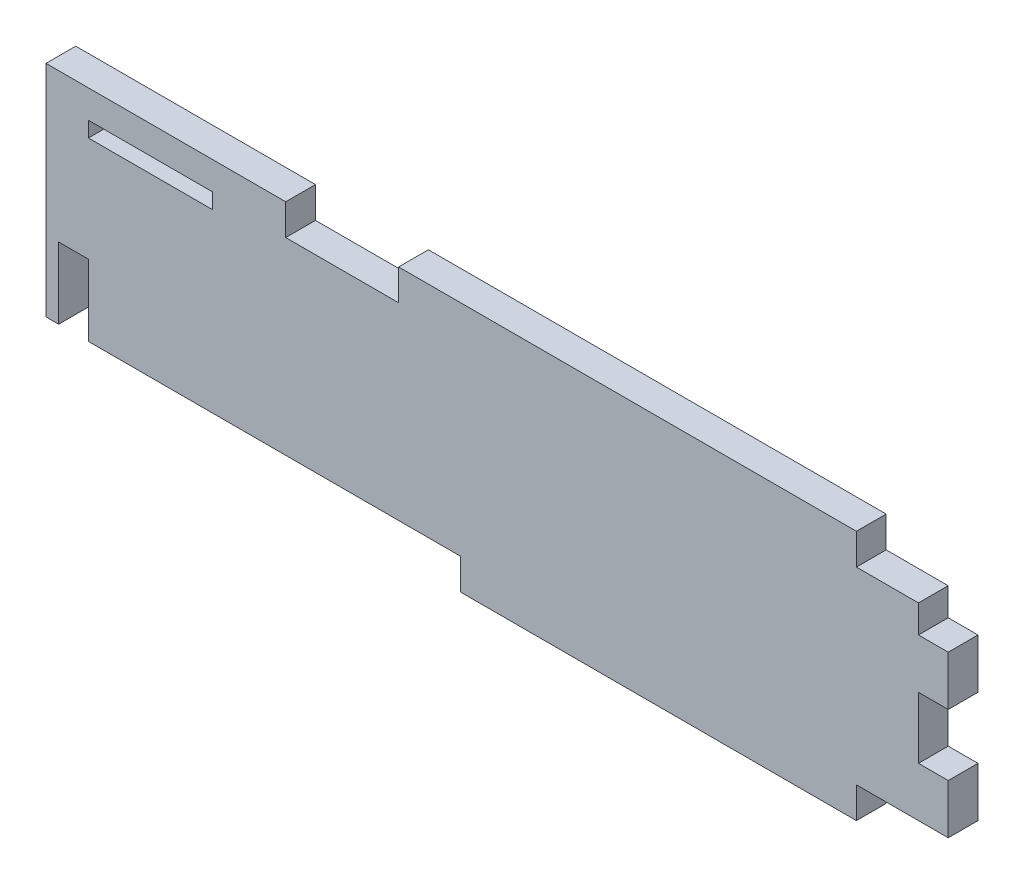
ISO-10303-21;
HEADER;
FILE_DESCRIPTION(('STEP AP214'),'2;1');
FILE_NAME('part.step','',(''),(''),'','','');
FILE_SCHEMA(('AUTOMOTIVE_DESIGN { 1 0 10303 214 1 1 1 1 }'));
ENDSEC;
DATA;
#1=APPLICATION_CONTEXT('core data for automotive mechanical design processes');
#2=APPLICATION_PROTOCOL_DEFINITION('international standard','automotive_design',2000,#1);
#3=PRODUCT_CONTEXT('',#1,'mechanical');
#4=PRODUCT('Part','Part','',(#3));
#5=PRODUCT_RELATED_PRODUCT_CATEGORY('part','',(#4));
#6=PRODUCT_DEFINITION_FORMATION('','',#4);
#7=PRODUCT_DEFINITION_CONTEXT('part definition',#1,'design');
#8=PRODUCT_DEFINITION('design','',#6,#7);
#9=PRODUCT_DEFINITION_SHAPE('','',#8);
#10=(LENGTH_UNIT() NAMED_UNIT(*) SI_UNIT(.MILLI.,.METRE.));
#11=(NAMED_UNIT(*) PLANE_ANGLE_UNIT() SI_UNIT($,.RADIAN.));
#12=(NAMED_UNIT(*) SI_UNIT($,.STERADIAN.) SOLID_ANGLE_UNIT());
#13=UNCERTAINTY_MEASURE_WITH_UNIT(LENGTH_MEASURE(1.E-05),#10,'distance_accuracy_value','');
#14=(GEOMETRIC_REPRESENTATION_CONTEXT(3) GLOBAL_UNCERTAINTY_ASSIGNED_CONTEXT((#13)) GLOBAL_UNIT_ASSIGNED_CONTEXT((#10,
#11,#12)) REPRESENTATION_CONTEXT('',''));
#15=CARTESIAN_POINT('',(0.,0.,0.));
#16=DIRECTION('',(0.,0.,1.));
#17=DIRECTION('',(1.,0.,0.));
#18=AXIS2_PLACEMENT_3D('',#15,#16,#17);
#19=CARTESIAN_POINT('',(0.,24.3332,3.048));
#20=DIRECTION('',(0.,-1.,0.));
#21=DIRECTION('',(0.,0.,-1.));
#22=AXIS2_PLACEMENT_3D('',#19,#20,#21);
#23=PLANE('',#22);
#24=DIRECTION('',(-1.,0.,0.));
#25=VECTOR('',#24,1.);
#26=CARTESIAN_POINT('',(0.,24.3332,0.));
#27=LINE('',#26,#25);
#28=CARTESIAN_POINT('',(-72.263,24.3332,0.));
#29=VERTEX_POINT('',#28);
#30=CARTESIAN_POINT('',(-84.963,24.3332,0.));
#31=VERTEX_POINT('',#30);
#32=EDGE_CURVE('E315',#29,#31,#27,.T.);
#33=ORIENTED_EDGE('',*,*,#32,.F.);
#34=DIRECTION('',(0.,0.,-1.));
#35=VECTOR('',#34,1.);
#36=CARTESIAN_POINT('',(-72.263,24.3332,3.048));
#37=LINE('',#36,#35);
#38=CARTESIAN_POINT('',(-72.263,24.3332,3.048));
#39=VERTEX_POINT('',#38);
#40=EDGE_CURVE('E11',#39,#29,#37,.T.);
#41=ORIENTED_EDGE('',*,*,#40,.F.);
#42=DIRECTION('',(-1.,0.,0.));
#43=VECTOR('',#42,1.);
#44=CARTESIAN_POINT('',(0.,24.3332,3.048));
#45=LINE('',#44,#43);
#46=CARTESIAN_POINT('',(-84.963,24.3332,3.048));
#47=VERTEX_POINT('',#46);
#48=EDGE_CURVE('E242',#39,#47,#45,.T.);
#49=ORIENTED_EDGE('',*,*,#48,.T.);
#50=DIRECTION('',(0.,0.,-1.));
#51=VECTOR('',#50,1.);
#52=CARTESIAN_POINT('',(-84.963,24.3332,3.048));
#53=LINE('',#52,#51);
#54=EDGE_CURVE('E61',#47,#31,#53,.T.);
#55=ORIENTED_EDGE('',*,*,#54,.T.);
#56=EDGE_LOOP('',(#33,#41,#49,#55));
#57=FACE_BOUND('',#56,.T.);
#58=ADVANCED_FACE('F35',(#57),#23,.T.);
#59=CARTESIAN_POINT('',(-72.263,0.,3.048));
#60=DIRECTION('',(-1.,0.,0.));
#61=DIRECTION('',(0.,0.,1.));
#62=AXIS2_PLACEMENT_3D('',#59,#60,#61);
#63=PLANE('',#62);
#64=DIRECTION('',(0.,1.,0.));
#65=VECTOR('',#64,1.);
#66=CARTESIAN_POINT('',(-72.263,0.,0.));
#67=LINE('',#66,#65);
#68=CARTESIAN_POINT('',(-72.263,22.7584,0.));
#69=VERTEX_POINT('',#68);
#70=EDGE_CURVE('E229',#69,#29,#67,.T.);
#71=ORIENTED_EDGE('',*,*,#70,.F.);
#72=DIRECTION('',(0.,0.,-1.));
#73=VECTOR('',#72,1.);
#74=CARTESIAN_POINT('',(-72.263,22.7584,3.048));
#75=LINE('',#74,#73);
#76=CARTESIAN_POINT('',(-72.263,22.7584,3.048));
#77=VERTEX_POINT('',#76);
#78=EDGE_CURVE('E44',#77,#69,#75,.T.);
#79=ORIENTED_EDGE('',*,*,#78,.F.);
#80=DIRECTION('',(0.,1.,0.));
#81=VECTOR('',#80,1.);
#82=CARTESIAN_POINT('',(-72.263,0.,3.048));
#83=LINE('',#82,#81);
#84=EDGE_CURVE('E227',#77,#39,#83,.T.);
#85=ORIENTED_EDGE('',*,*,#84,.T.);
#86=ORIENTED_EDGE('',*,*,#40,.T.);
#87=EDGE_LOOP('',(#71,#79,#85,#86));
#88=FACE_BOUND('',#87,.T.);
#89=ADVANCED_FACE('F226',(#88),#63,.T.);
#90=CARTESIAN_POINT('',(0.,22.7584,3.048));
#91=DIRECTION('',(0.,1.,0.));
#92=DIRECTION('',(0.,0.,1.));
#93=AXIS2_PLACEMENT_3D('',#90,#91,#92);
#94=PLANE('',#93);
#95=DIRECTION('',(1.,0.,0.));
#96=VECTOR('',#95,1.);
#97=CARTESIAN_POINT('',(0.,22.7584,0.));
#98=LINE('',#97,#96);
#99=CARTESIAN_POINT('',(-84.963,22.7584,0.));
#100=VERTEX_POINT('',#99);
#101=EDGE_CURVE('E318',#100,#69,#98,.T.);
#102=ORIENTED_EDGE('',*,*,#101,.F.);
#103=DIRECTION('',(0.,0.,-1.));
#104=VECTOR('',#103,1.);
#105=CARTESIAN_POINT('',(-84.963,22.7584,3.048));
#106=LINE('',#105,#104);
#107=CARTESIAN_POINT('',(-84.963,22.7584,3.048));
#108=VERTEX_POINT('',#107);
#109=EDGE_CURVE('E234',#108,#100,#106,.T.);
#110=ORIENTED_EDGE('',*,*,#109,.F.);
#111=DIRECTION('',(1.,0.,0.));
#112=VECTOR('',#111,1.);
#113=CARTESIAN_POINT('',(0.,22.7584,3.048));
#114=LINE('',#113,#112);
#115=EDGE_CURVE('E241',#108,#77,#114,.T.);
#116=ORIENTED_EDGE('',*,*,#115,.T.);
#117=ORIENTED_EDGE('',*,*,#78,.T.);
#118=EDGE_LOOP('',(#102,#110,#116,#117));
#119=FACE_BOUND('',#118,.T.);
#120=ADVANCED_FACE('F244',(#119),#94,.T.);
#121=CARTESIAN_POINT('',(-64.77,0.,3.048));
#122=DIRECTION('',(1.,0.,0.));
#123=DIRECTION('',(0.,0.,-1.));
#124=AXIS2_PLACEMENT_3D('',#121,#122,#123);
#125=PLANE('',#124);
#126=DIRECTION('',(0.,-1.,0.));
#127=VECTOR('',#126,1.);
#128=CARTESIAN_POINT('',(-64.77,0.,0.));
#129=LINE('',#128,#127);
#130=CARTESIAN_POINT('',(-64.77,27.2034,0.));
#131=VERTEX_POINT('',#130);
#132=CARTESIAN_POINT('',(-64.77,24.0284,0.));
#133=VERTEX_POINT('',#132);
#134=EDGE_CURVE('E251',#131,#133,#129,.T.);
#135=ORIENTED_EDGE('',*,*,#134,.F.);
#136=DIRECTION('',(0.,0.,-1.));
#137=VECTOR('',#136,1.);
#138=CARTESIAN_POINT('',(-64.77,27.2034,3.048));
#139=LINE('',#138,#137);
#140=CARTESIAN_POINT('',(-64.77,27.2034,3.048));
#141=VERTEX_POINT('',#140);
#142=EDGE_CURVE('E39',#141,#131,#139,.T.);
#143=ORIENTED_EDGE('',*,*,#142,.F.);
#144=DIRECTION('',(0.,-1.,0.));
#145=VECTOR('',#144,1.);
#146=CARTESIAN_POINT('',(-64.77,0.,3.048));
#147=LINE('',#146,#145);
#148=CARTESIAN_POINT('',(-64.77,24.0284,3.048));
#149=VERTEX_POINT('',#148);
#150=EDGE_CURVE('E323',#141,#149,#147,.T.);
#151=ORIENTED_EDGE('',*,*,#150,.T.);
#152=DIRECTION('',(0.,0.,-1.));
#153=VECTOR('',#152,1.);
#154=CARTESIAN_POINT('',(-64.77,24.0284,3.048));
#155=LINE('',#154,#153);
#156=EDGE_CURVE('E247',#149,#133,#155,.T.);
#157=ORIENTED_EDGE('',*,*,#156,.T.);
#158=EDGE_LOOP('',(#135,#143,#151,#157));
#159=FACE_BOUND('',#158,.T.);
#160=ADVANCED_FACE('F37',(#159),#125,.T.);
#161=CARTESIAN_POINT('',(0.,27.2034,3.048));
#162=DIRECTION('',(0.,1.,0.));
#163=DIRECTION('',(0.,0.,1.));
#164=AXIS2_PLACEMENT_3D('',#161,#162,#163);
#165=PLANE('',#164);
#166=DIRECTION('',(1.,0.,0.));
#167=VECTOR('',#166,1.);
#168=CARTESIAN_POINT('',(0.,27.2034,0.));
#169=LINE('',#168,#167);
#170=CARTESIAN_POINT('',(-89.3064,27.2034,0.));
#171=VERTEX_POINT('',#170);
#172=EDGE_CURVE('E254',#171,#131,#169,.T.);
#173=ORIENTED_EDGE('',*,*,#172,.F.);
#174=DIRECTION('',(0.,0.,-1.));
#175=VECTOR('',#174,1.);
#176=CARTESIAN_POINT('',(-89.3064,27.2034,3.048));
#177=LINE('',#176,#175);
#178=CARTESIAN_POINT('',(-89.3064,27.2034,3.048));
#179=VERTEX_POINT('',#178);
#180=EDGE_CURVE('E369',#179,#171,#177,.T.);
#181=ORIENTED_EDGE('',*,*,#180,.F.);
#182=DIRECTION('',(1.,0.,0.));
#183=VECTOR('',#182,1.);
#184=CARTESIAN_POINT('',(0.,27.2034,3.048));
#185=LINE('',#184,#183);
#186=EDGE_CURVE('E378',#179,#141,#185,.T.);
#187=ORIENTED_EDGE('',*,*,#186,.T.);
#188=ORIENTED_EDGE('',*,*,#142,.T.);
#189=EDGE_LOOP('',(#173,#181,#187,#188));
#190=FACE_BOUND('',#189,.T.);
#191=ADVANCED_FACE('F376',(#190),#165,.T.);
#192=CARTESIAN_POINT('',(-89.3064,0.,3.048));
#193=DIRECTION('',(-1.,0.,0.));
#194=DIRECTION('',(0.,0.,1.));
#195=AXIS2_PLACEMENT_3D('',#192,#193,#194);
#196=PLANE('',#195);
#197=DIRECTION('',(0.,1.,0.));
#198=VECTOR('',#197,1.);
#199=CARTESIAN_POINT('',(-89.3064,0.,0.));
#200=LINE('',#199,#198);
#201=CARTESIAN_POINT('',(-89.3064,4.72440000000001,0.));
#202=VERTEX_POINT('',#201);
#203=EDGE_CURVE('E258',#202,#171,#200,.T.);
#204=ORIENTED_EDGE('',*,*,#203,.F.);
#205=DIRECTION('',(0.,0.,-1.));
#206=VECTOR('',#205,1.);
#207=CARTESIAN_POINT('',(-89.3064,4.72440000000001,3.048));
#208=LINE('',#207,#206);
#209=CARTESIAN_POINT('',(-89.3064,4.72440000000001,3.048));
#210=VERTEX_POINT('',#209);
#211=EDGE_CURVE('E368',#210,#202,#208,.T.);
#212=ORIENTED_EDGE('',*,*,#211,.F.);
#213=DIRECTION('',(0.,1.,0.));
#214=VECTOR('',#213,1.);
#215=CARTESIAN_POINT('',(-89.3064,0.,3.048));
#216=LINE('',#215,#214);
#217=EDGE_CURVE('E385',#210,#179,#216,.T.);
#218=ORIENTED_EDGE('',*,*,#217,.T.);
#219=ORIENTED_EDGE('',*,*,#180,.T.);
#220=EDGE_LOOP('',(#204,#212,#218,#219));
#221=FACE_BOUND('',#220,.T.);
#222=ADVANCED_FACE('F382',(#221),#196,.T.);
#223=CARTESIAN_POINT('',(0.,4.72440000000001,3.048));
#224=DIRECTION('',(0.,1.,0.));
#225=DIRECTION('',(0.,0.,1.));
#226=AXIS2_PLACEMENT_3D('',#223,#224,#225);
#227=PLANE('',#226);
#228=DIRECTION('',(1.,0.,0.));
#229=VECTOR('',#228,1.);
#230=CARTESIAN_POINT('',(0.,4.72440000000001,0.));
#231=LINE('',#230,#229);
#232=CARTESIAN_POINT('',(-88.011,4.7244,0.));
#233=VERTEX_POINT('',#232);
#234=EDGE_CURVE('E261',#202,#233,#231,.T.);
#235=ORIENTED_EDGE('',*,*,#234,.T.);
#236=DIRECTION('',(0.,0.,1.));
#237=VECTOR('',#236,1.);
#238=CARTESIAN_POINT('',(-88.011,4.7244,0.));
#239=LINE('',#238,#237);
#240=CARTESIAN_POINT('',(-88.011,4.7244,3.048));
#241=VERTEX_POINT('',#240);
#242=EDGE_CURVE('E393',#233,#241,#239,.T.);
#243=ORIENTED_EDGE('',*,*,#242,.T.);
#244=DIRECTION('',(1.,0.,0.));
#245=VECTOR('',#244,1.);
#246=CARTESIAN_POINT('',(0.,4.72440000000001,3.048));
#247=LINE('',#246,#245);
#248=EDGE_CURVE('E389',#210,#241,#247,.T.);
#249=ORIENTED_EDGE('',*,*,#248,.F.);
#250=ORIENTED_EDGE('',*,*,#211,.T.);
#251=EDGE_LOOP('',(#235,#243,#249,#250));
#252=FACE_BOUND('',#251,.T.);
#253=ADVANCED_FACE('F390',(#252),#227,.F.);
#254=CARTESIAN_POINT('',(0.,12.0142,3.048));
#255=DIRECTION('',(0.,1.,0.));
#256=DIRECTION('',(0.,0.,1.));
#257=AXIS2_PLACEMENT_3D('',#254,#255,#256);
#258=PLANE('',#257);
#259=DIRECTION('',(1.,0.,0.));
#260=VECTOR('',#259,1.);
#261=CARTESIAN_POINT('',(0.,12.0142,0.));
#262=LINE('',#261,#260);
#263=CARTESIAN_POINT('',(-88.011,12.0142,0.));
#264=VERTEX_POINT('',#263);
#265=CARTESIAN_POINT('',(-84.963,12.0142,0.));
#266=VERTEX_POINT('',#265);
#267=EDGE_CURVE('E52',#264,#266,#262,.T.);
#268=ORIENTED_EDGE('',*,*,#267,.T.);
#269=DIRECTION('',(0.,0.,-1.));
#270=VECTOR('',#269,1.);
#271=CARTESIAN_POINT('',(-84.963,12.0142,3.048));
#272=LINE('',#271,#270);
#273=CARTESIAN_POINT('',(-84.963,12.0142,3.048));
#274=VERTEX_POINT('',#273);
#275=EDGE_CURVE('E365',#274,#266,#272,.T.);
#276=ORIENTED_EDGE('',*,*,#275,.F.);
#277=DIRECTION('',(1.,0.,0.));
#278=VECTOR('',#277,1.);
#279=CARTESIAN_POINT('',(0.,12.0142,3.048));
#280=LINE('',#279,#278);
#281=CARTESIAN_POINT('',(-88.011,12.0142,3.048));
#282=VERTEX_POINT('',#281);
#283=EDGE_CURVE('E396',#282,#274,#280,.T.);
#284=ORIENTED_EDGE('',*,*,#283,.F.);
#285=DIRECTION('',(0.,0.,1.));
#286=VECTOR('',#285,1.);
#287=CARTESIAN_POINT('',(-88.011,12.0142,0.));
#288=LINE('',#287,#286);
#289=EDGE_CURVE('E255',#264,#282,#288,.T.);
#290=ORIENTED_EDGE('',*,*,#289,.F.);
#291=EDGE_LOOP('',(#268,#276,#284,#290));
#292=FACE_BOUND('',#291,.T.);
#293=ADVANCED_FACE('F539',(#292),#258,.F.);
#294=CARTESIAN_POINT('',(-84.963,0.,3.048));
#295=DIRECTION('',(1.,0.,0.));
#296=DIRECTION('',(0.,0.,-1.));
#297=AXIS2_PLACEMENT_3D('',#294,#295,#296);
#298=PLANE('',#297);
#299=DIRECTION('',(0.,-1.,0.));
#300=VECTOR('',#299,1.);
#301=CARTESIAN_POINT('',(-84.963,0.,0.));
#302=LINE('',#301,#300);
#303=CARTESIAN_POINT('',(-84.963,4.7244,0.));
#304=VERTEX_POINT('',#303);
#305=EDGE_CURVE('E265',#266,#304,#302,.T.);
#306=ORIENTED_EDGE('',*,*,#305,.T.);
#307=DIRECTION('',(0.,0.,-1.));
#308=VECTOR('',#307,1.);
#309=CARTESIAN_POINT('',(-84.963,4.7244,3.048));
#310=LINE('',#309,#308);
#311=CARTESIAN_POINT('',(-84.963,4.7244,3.048));
#312=VERTEX_POINT('',#311);
#313=EDGE_CURVE('E362',#312,#304,#310,.T.);
#314=ORIENTED_EDGE('',*,*,#313,.F.);
#315=DIRECTION('',(0.,-1.,0.));
#316=VECTOR('',#315,1.);
#317=CARTESIAN_POINT('',(-84.963,0.,3.048));
#318=LINE('',#317,#316);
#319=EDGE_CURVE('E403',#274,#312,#318,.T.);
#320=ORIENTED_EDGE('',*,*,#319,.F.);
#321=ORIENTED_EDGE('',*,*,#275,.T.);
#322=EDGE_LOOP('',(#306,#314,#320,#321));
#323=FACE_BOUND('',#322,.T.);
#324=ADVANCED_FACE('F535',(#323),#298,.F.);
#325=CARTESIAN_POINT('',(0.,4.7244,3.048));
#326=DIRECTION('',(0.,1.,0.));
#327=DIRECTION('',(0.,0.,1.));
#328=AXIS2_PLACEMENT_3D('',#325,#326,#327);
#329=PLANE('',#328);
#330=DIRECTION('',(1.,0.,0.));
#331=VECTOR('',#330,1.);
#332=CARTESIAN_POINT('',(0.,4.7244,0.));
#333=LINE('',#332,#331);
#334=CARTESIAN_POINT('',(-46.863,4.7244,0.));
#335=VERTEX_POINT('',#334);
#336=EDGE_CURVE('E267',#304,#335,#333,.T.);
#337=ORIENTED_EDGE('',*,*,#336,.T.);
#338=DIRECTION('',(0.,0.,-1.));
#339=VECTOR('',#338,1.);
#340=CARTESIAN_POINT('',(-46.863,4.7244,3.048));
#341=LINE('',#340,#339);
#342=CARTESIAN_POINT('',(-46.863,4.7244,3.048));
#343=VERTEX_POINT('',#342);
#344=EDGE_CURVE('E360',#343,#335,#341,.T.);
#345=ORIENTED_EDGE('',*,*,#344,.F.);
#346=DIRECTION('',(1.,0.,0.));
#347=VECTOR('',#346,1.);
#348=CARTESIAN_POINT('',(0.,4.7244,3.048));
#349=LINE('',#348,#347);
#350=EDGE_CURVE('E405',#312,#343,#349,.T.);
#351=ORIENTED_EDGE('',*,*,#350,.F.);
#352=ORIENTED_EDGE('',*,*,#313,.T.);
#353=EDGE_LOOP('',(#337,#345,#351,#352));
#354=FACE_BOUND('',#353,.T.);
#355=ADVANCED_FACE('F531',(#354),#329,.F.);
#356=CARTESIAN_POINT('',(-46.863,0.,3.048));
#357=DIRECTION('',(-1.,0.,0.));
#358=DIRECTION('',(0.,0.,1.));
#359=AXIS2_PLACEMENT_3D('',#356,#357,#358);
#360=PLANE('',#359);
#361=DIRECTION('',(0.,1.,0.));
#362=VECTOR('',#361,1.);
#363=CARTESIAN_POINT('',(-46.863,0.,0.));
#364=LINE('',#363,#362);
#365=CARTESIAN_POINT('',(-46.863,1.5494,0.));
#366=VERTEX_POINT('',#365);
#367=EDGE_CURVE('E270',#366,#335,#364,.T.);
#368=ORIENTED_EDGE('',*,*,#367,.F.);
#369=DIRECTION('',(0.,0.,-1.));
#370=VECTOR('',#369,1.);
#371=CARTESIAN_POINT('',(-46.863,1.5494,3.048));
#372=LINE('',#371,#370);
#373=CARTESIAN_POINT('',(-46.863,1.5494,3.048));
#374=VERTEX_POINT('',#373);
#375=EDGE_CURVE('E358',#374,#366,#372,.T.);
#376=ORIENTED_EDGE('',*,*,#375,.F.);
#377=DIRECTION('',(0.,1.,0.));
#378=VECTOR('',#377,1.);
#379=CARTESIAN_POINT('',(-46.863,0.,3.048));
#380=LINE('',#379,#378);
#381=EDGE_CURVE('E407',#374,#343,#380,.T.);
#382=ORIENTED_EDGE('',*,*,#381,.T.);
#383=ORIENTED_EDGE('',*,*,#344,.T.);
#384=EDGE_LOOP('',(#368,#376,#382,#383));
#385=FACE_BOUND('',#384,.T.);
#386=ADVANCED_FACE('F527',(#385),#360,.T.);
#387=CARTESIAN_POINT('',(0.,1.5494,3.048));
#388=DIRECTION('',(0.,-1.,0.));
#389=DIRECTION('',(1.,0.,0.));
#390=AXIS2_PLACEMENT_3D('',#387,#388,#389);
#391=PLANE('',#390);
#392=DIRECTION('',(-1.,0.,0.));
#393=VECTOR('',#392,1.);
#394=CARTESIAN_POINT('',(0.,1.5494,0.));
#395=LINE('',#394,#393);
#396=CARTESIAN_POINT('',(-6.35,1.5494,0.));
#397=VERTEX_POINT('',#396);
#398=EDGE_CURVE('E273',#397,#366,#395,.T.);
#399=ORIENTED_EDGE('',*,*,#398,.F.);
#400=DIRECTION('',(0.,0.,-1.));
#401=VECTOR('',#400,1.);
#402=CARTESIAN_POINT('',(-6.35,1.5494,3.048));
#403=LINE('',#402,#401);
#404=CARTESIAN_POINT('',(-6.35,1.5494,3.048));
#405=VERTEX_POINT('',#404);
#406=EDGE_CURVE('E356',#405,#397,#403,.T.);
#407=ORIENTED_EDGE('',*,*,#406,.F.);
#408=DIRECTION('',(-1.,0.,0.));
#409=VECTOR('',#408,1.);
#410=CARTESIAN_POINT('',(0.,1.5494,3.048));
#411=LINE('',#410,#409);
#412=EDGE_CURVE('E410',#405,#374,#411,.T.);
#413=ORIENTED_EDGE('',*,*,#412,.T.);
#414=ORIENTED_EDGE('',*,*,#375,.T.);
#415=EDGE_LOOP('',(#399,#407,#413,#414));
#416=FACE_BOUND('',#415,.T.);
#417=ADVANCED_FACE('F523',(#416),#391,.T.);
#418=CARTESIAN_POINT('',(-6.35,0.,3.048));
#419=DIRECTION('',(1.,0.,0.));
#420=DIRECTION('',(0.,0.,-1.));
#421=AXIS2_PLACEMENT_3D('',#418,#419,#420);
#422=PLANE('',#421);
#423=DIRECTION('',(0.,-1.,0.));
#424=VECTOR('',#423,1.);
#425=CARTESIAN_POINT('',(-6.35,0.,0.));
#426=LINE('',#425,#424);
#427=CARTESIAN_POINT('',(-6.35,4.7244,0.));
#428=VERTEX_POINT('',#427);
#429=EDGE_CURVE('E276',#428,#397,#426,.T.);
#430=ORIENTED_EDGE('',*,*,#429,.F.);
#431=DIRECTION('',(0.,0.,-1.));
#432=VECTOR('',#431,1.);
#433=CARTESIAN_POINT('',(-6.35,4.7244,3.048));
#434=LINE('',#433,#432);
#435=CARTESIAN_POINT('',(-6.35,4.7244,3.048));
#436=VERTEX_POINT('',#435);
#437=EDGE_CURVE('E354',#436,#428,#434,.T.);
#438=ORIENTED_EDGE('',*,*,#437,.F.);
#439=DIRECTION('',(0.,-1.,0.));
#440=VECTOR('',#439,1.);
#441=CARTESIAN_POINT('',(-6.35,0.,3.048));
#442=LINE('',#441,#440);
#443=EDGE_CURVE('E413',#436,#405,#442,.T.);
#444=ORIENTED_EDGE('',*,*,#443,.T.);
#445=ORIENTED_EDGE('',*,*,#406,.T.);
#446=EDGE_LOOP('',(#430,#438,#444,#445));
#447=FACE_BOUND('',#446,.T.);
#448=ADVANCED_FACE('F519',(#447),#422,.T.);
#449=CARTESIAN_POINT('',(0.,4.72439999999999,3.048));
#450=DIRECTION('',(0.,1.,0.));
#451=DIRECTION('',(-1.,0.,0.));
#452=AXIS2_PLACEMENT_3D('',#449,#450,#451);
#453=PLANE('',#452);
#454=DIRECTION('',(1.,0.,0.));
#455=VECTOR('',#454,1.);
#456=CARTESIAN_POINT('',(0.,4.72439999999999,0.));
#457=LINE('',#456,#455);
#458=CARTESIAN_POINT('',(3.048,4.72439999999999,0.));
#459=VERTEX_POINT('',#458);
#460=EDGE_CURVE('E279',#428,#459,#457,.T.);
#461=ORIENTED_EDGE('',*,*,#460,.T.);
#462=DIRECTION('',(0.,0.,-1.));
#463=VECTOR('',#462,1.);
#464=CARTESIAN_POINT('',(3.048,4.72439999999999,3.048));
#465=LINE('',#464,#463);
#466=CARTESIAN_POINT('',(3.048,4.72439999999999,3.048));
#467=VERTEX_POINT('',#466);
#468=EDGE_CURVE('E352',#467,#459,#465,.T.);
#469=ORIENTED_EDGE('',*,*,#468,.F.);
#470=DIRECTION('',(1.,0.,0.));
#471=VECTOR('',#470,1.);
#472=CARTESIAN_POINT('',(0.,4.72439999999999,3.048));
#473=LINE('',#472,#471);
#474=EDGE_CURVE('E416',#436,#467,#473,.T.);
#475=ORIENTED_EDGE('',*,*,#474,.F.);
#476=ORIENTED_EDGE('',*,*,#437,.T.);
#477=EDGE_LOOP('',(#461,#469,#475,#476));
#478=FACE_BOUND('',#477,.T.);
#479=ADVANCED_FACE('F515',(#478),#453,.F.);
#480=CARTESIAN_POINT('',(3.048,0.,3.048));
#481=DIRECTION('',(1.,0.,0.));
#482=DIRECTION('',(0.,0.,-1.));
#483=AXIS2_PLACEMENT_3D('',#480,#481,#482);
#484=PLANE('',#483);
#485=DIRECTION('',(0.,-1.,0.));
#486=VECTOR('',#485,1.);
#487=CARTESIAN_POINT('',(3.048,0.,0.));
#488=LINE('',#487,#486);
#489=CARTESIAN_POINT('',(3.048,9.80439999999999,0.));
#490=VERTEX_POINT('',#489);
#491=EDGE_CURVE('E282',#490,#459,#488,.T.);
#492=ORIENTED_EDGE('',*,*,#491,.F.);
#493=DIRECTION('',(0.,0.,-1.));
#494=VECTOR('',#493,1.);
#495=CARTESIAN_POINT('',(3.048,9.80439999999999,3.048));
#496=LINE('',#495,#494);
#497=CARTESIAN_POINT('',(3.048,9.80439999999999,3.048));
#498=VERTEX_POINT('',#497);
#499=EDGE_CURVE('E350',#498,#490,#496,.T.);
#500=ORIENTED_EDGE('',*,*,#499,.F.);
#501=DIRECTION('',(0.,-1.,0.));
#502=VECTOR('',#501,1.);
#503=CARTESIAN_POINT('',(3.048,0.,3.048));
#504=LINE('',#503,#502);
#505=EDGE_CURVE('E418',#498,#467,#504,.T.);
#506=ORIENTED_EDGE('',*,*,#505,.T.);
#507=ORIENTED_EDGE('',*,*,#468,.T.);
#508=EDGE_LOOP('',(#492,#500,#506,#507));
#509=FACE_BOUND('',#508,.T.);
#510=ADVANCED_FACE('F511',(#509),#484,.T.);
#511=CARTESIAN_POINT('',(0.,9.80439999999999,3.048));
#512=DIRECTION('',(0.,-1.,0.));
#513=DIRECTION('',(0.,0.,-1.));
#514=AXIS2_PLACEMENT_3D('',#511,#512,#513);
#515=PLANE('',#514);
#516=DIRECTION('',(-1.,0.,0.));
#517=VECTOR('',#516,1.);
#518=CARTESIAN_POINT('',(0.,9.80439999999999,0.));
#519=LINE('',#518,#517);
#520=CARTESIAN_POINT('',(0.,9.80439999999999,0.));
#521=VERTEX_POINT('',#520);
#522=EDGE_CURVE('E285',#490,#521,#519,.T.);
#523=ORIENTED_EDGE('',*,*,#522,.T.);
#524=DIRECTION('',(0.,0.,-1.));
#525=VECTOR('',#524,1.);
#526=CARTESIAN_POINT('',(0.,9.80439999999999,3.048));
#527=LINE('',#526,#525);
#528=CARTESIAN_POINT('',(0.,9.80439999999999,3.048));
#529=VERTEX_POINT('',#528);
#530=EDGE_CURVE('E348',#529,#521,#527,.T.);
#531=ORIENTED_EDGE('',*,*,#530,.F.);
#532=DIRECTION('',(-1.,0.,0.));
#533=VECTOR('',#532,1.);
#534=CARTESIAN_POINT('',(0.,9.80439999999999,3.048));
#535=LINE('',#534,#533);
#536=EDGE_CURVE('E421',#498,#529,#535,.T.);
#537=ORIENTED_EDGE('',*,*,#536,.F.);
#538=ORIENTED_EDGE('',*,*,#499,.T.);
#539=EDGE_LOOP('',(#523,#531,#537,#538));
#540=FACE_BOUND('',#539,.T.);
#541=ADVANCED_FACE('F507',(#540),#515,.F.);
#542=CARTESIAN_POINT('',(0.,0.,3.048));
#543=DIRECTION('',(1.,0.,0.));
#544=DIRECTION('',(0.,0.,-1.));
#545=AXIS2_PLACEMENT_3D('',#542,#543,#544);
#546=PLANE('',#545);
#547=DIRECTION('',(0.,-1.,0.));
#548=VECTOR('',#547,1.);
#549=CARTESIAN_POINT('',(0.,0.,0.));
#550=LINE('',#549,#548);
#551=CARTESIAN_POINT('',(0.,16.1036,0.));
#552=VERTEX_POINT('',#551);
#553=EDGE_CURVE('E288',#552,#521,#550,.T.);
#554=ORIENTED_EDGE('',*,*,#553,.F.);
#555=DIRECTION('',(0.,0.,-1.));
#556=VECTOR('',#555,1.);
#557=CARTESIAN_POINT('',(0.,16.1036,3.048));
#558=LINE('',#557,#556);
#559=CARTESIAN_POINT('',(0.,16.1036,3.048));
#560=VERTEX_POINT('',#559);
#561=EDGE_CURVE('E346',#560,#552,#558,.T.);
#562=ORIENTED_EDGE('',*,*,#561,.F.);
#563=DIRECTION('',(0.,-1.,0.));
#564=VECTOR('',#563,1.);
#565=CARTESIAN_POINT('',(0.,0.,3.048));
#566=LINE('',#565,#564);
#567=EDGE_CURVE('E423',#560,#529,#566,.T.);
#568=ORIENTED_EDGE('',*,*,#567,.T.);
#569=ORIENTED_EDGE('',*,*,#530,.T.);
#570=EDGE_LOOP('',(#554,#562,#568,#569));
#571=FACE_BOUND('',#570,.T.);
#572=ADVANCED_FACE('F503',(#571),#546,.T.);
#573=CARTESIAN_POINT('',(0.,16.1036,3.048));
#574=DIRECTION('',(0.,-1.,0.));
#575=DIRECTION('',(0.,0.,-1.));
#576=AXIS2_PLACEMENT_3D('',#573,#574,#575);
#577=PLANE('',#576);
#578=DIRECTION('',(-1.,0.,0.));
#579=VECTOR('',#578,1.);
#580=CARTESIAN_POINT('',(0.,16.1036,0.));
#581=LINE('',#580,#579);
#582=CARTESIAN_POINT('',(3.048,16.1036,0.));
#583=VERTEX_POINT('',#582);
#584=EDGE_CURVE('E291',#583,#552,#581,.T.);
#585=ORIENTED_EDGE('',*,*,#584,.F.);
#586=DIRECTION('',(0.,0.,-1.));
#587=VECTOR('',#586,1.);
#588=CARTESIAN_POINT('',(3.048,16.1036,3.048));
#589=LINE('',#588,#587);
#590=CARTESIAN_POINT('',(3.048,16.1036,3.048));
#591=VERTEX_POINT('',#590);
#592=EDGE_CURVE('E344',#591,#583,#589,.T.);
#593=ORIENTED_EDGE('',*,*,#592,.F.);
#594=DIRECTION('',(-1.,0.,0.));
#595=VECTOR('',#594,1.);
#596=CARTESIAN_POINT('',(0.,16.1036,3.048));
#597=LINE('',#596,#595);
#598=EDGE_CURVE('E426',#591,#560,#597,.T.);
#599=ORIENTED_EDGE('',*,*,#598,.T.);
#600=ORIENTED_EDGE('',*,*,#561,.T.);
#601=EDGE_LOOP('',(#585,#593,#599,#600));
#602=FACE_BOUND('',#601,.T.);
#603=ADVANCED_FACE('F499',(#602),#577,.T.);
#604=CARTESIAN_POINT('',(3.048,0.,3.048));
#605=DIRECTION('',(1.,0.,0.));
#606=DIRECTION('',(0.,0.,-1.));
#607=AXIS2_PLACEMENT_3D('',#604,#605,#606);
#608=PLANE('',#607);
#609=DIRECTION('',(0.,-1.,0.));
#610=VECTOR('',#609,1.);
#611=CARTESIAN_POINT('',(3.048,0.,0.));
#612=LINE('',#611,#610);
#613=CARTESIAN_POINT('',(3.048,21.1836,0.));
#614=VERTEX_POINT('',#613);
#615=EDGE_CURVE('E294',#614,#583,#612,.T.);
#616=ORIENTED_EDGE('',*,*,#615,.F.);
#617=DIRECTION('',(0.,0.,-1.));
#618=VECTOR('',#617,1.);
#619=CARTESIAN_POINT('',(3.048,21.1836,3.048));
#620=LINE('',#619,#618);
#621=CARTESIAN_POINT('',(3.048,21.1836,3.048));
#622=VERTEX_POINT('',#621);
#623=EDGE_CURVE('E342',#622,#614,#620,.T.);
#624=ORIENTED_EDGE('',*,*,#623,.F.);
#625=DIRECTION('',(0.,-1.,0.));
#626=VECTOR('',#625,1.);
#627=CARTESIAN_POINT('',(3.048,0.,3.048));
#628=LINE('',#627,#626);
#629=EDGE_CURVE('E429',#622,#591,#628,.T.);
#630=ORIENTED_EDGE('',*,*,#629,.T.);
#631=ORIENTED_EDGE('',*,*,#592,.T.);
#632=EDGE_LOOP('',(#616,#624,#630,#631));
#633=FACE_BOUND('',#632,.T.);
#634=ADVANCED_FACE('F495',(#633),#608,.T.);
#635=CARTESIAN_POINT('',(0.,21.1836,3.048));
#636=DIRECTION('',(0.,-1.,0.));
#637=DIRECTION('',(0.,0.,-1.));
#638=AXIS2_PLACEMENT_3D('',#635,#636,#637);
#639=PLANE('',#638);
#640=DIRECTION('',(-1.,0.,0.));
#641=VECTOR('',#640,1.);
#642=CARTESIAN_POINT('',(0.,21.1836,0.));
#643=LINE('',#642,#641);
#644=CARTESIAN_POINT('',(0.,21.1836,0.));
#645=VERTEX_POINT('',#644);
#646=EDGE_CURVE('E297',#614,#645,#643,.T.);
#647=ORIENTED_EDGE('',*,*,#646,.T.);
#648=DIRECTION('',(0.,0.,-1.));
#649=VECTOR('',#648,1.);
#650=CARTESIAN_POINT('',(0.,21.1836,3.048));
#651=LINE('',#650,#649);
#652=CARTESIAN_POINT('',(0.,21.1836,3.048));
#653=VERTEX_POINT('',#652);
#654=EDGE_CURVE('E340',#653,#645,#651,.T.);
#655=ORIENTED_EDGE('',*,*,#654,.F.);
#656=DIRECTION('',(-1.,0.,0.));
#657=VECTOR('',#656,1.);
#658=CARTESIAN_POINT('',(0.,21.1836,3.048));
#659=LINE('',#658,#657);
#660=EDGE_CURVE('E432',#622,#653,#659,.T.);
#661=ORIENTED_EDGE('',*,*,#660,.F.);
#662=ORIENTED_EDGE('',*,*,#623,.T.);
#663=EDGE_LOOP('',(#647,#655,#661,#662));
#664=FACE_BOUND('',#663,.T.);
#665=ADVANCED_FACE('F491',(#664),#639,.F.);
#666=CARTESIAN_POINT('',(0.,0.,3.048));
#667=DIRECTION('',(1.,0.,0.));
#668=DIRECTION('',(0.,0.,-1.));
#669=AXIS2_PLACEMENT_3D('',#666,#667,#668);
#670=PLANE('',#669);
#671=DIRECTION('',(0.,-1.,0.));
#672=VECTOR('',#671,1.);
#673=CARTESIAN_POINT('',(0.,0.,0.));
#674=LINE('',#673,#672);
#675=CARTESIAN_POINT('',(0.,24.0284,0.));
#676=VERTEX_POINT('',#675);
#677=EDGE_CURVE('E300',#676,#645,#674,.T.);
#678=ORIENTED_EDGE('',*,*,#677,.F.);
#679=DIRECTION('',(0.,0.,-1.));
#680=VECTOR('',#679,1.);
#681=CARTESIAN_POINT('',(0.,24.0284,3.048));
#682=LINE('',#681,#680);
#683=CARTESIAN_POINT('',(0.,24.0284,3.048));
#684=VERTEX_POINT('',#683);
#685=EDGE_CURVE('E338',#684,#676,#682,.T.);
#686=ORIENTED_EDGE('',*,*,#685,.F.);
#687=DIRECTION('',(0.,-1.,0.));
#688=VECTOR('',#687,1.);
#689=CARTESIAN_POINT('',(0.,0.,3.048));
#690=LINE('',#689,#688);
#691=EDGE_CURVE('E434',#684,#653,#690,.T.);
#692=ORIENTED_EDGE('',*,*,#691,.T.);
#693=ORIENTED_EDGE('',*,*,#654,.T.);
#694=EDGE_LOOP('',(#678,#686,#692,#693));
#695=FACE_BOUND('',#694,.T.);
#696=ADVANCED_FACE('F487',(#695),#670,.T.);
#697=CARTESIAN_POINT('',(0.,24.0284,3.048));
#698=DIRECTION('',(0.,-1.,0.));
#699=DIRECTION('',(1.,0.,0.));
#700=AXIS2_PLACEMENT_3D('',#697,#698,#699);
#701=PLANE('',#700);
#702=DIRECTION('',(-1.,0.,0.));
#703=VECTOR('',#702,1.);
#704=CARTESIAN_POINT('',(0.,24.0284,0.));
#705=LINE('',#704,#703);
#706=CARTESIAN_POINT('',(-6.35,24.0284,0.));
#707=VERTEX_POINT('',#706);
#708=EDGE_CURVE('E303',#676,#707,#705,.T.);
#709=ORIENTED_EDGE('',*,*,#708,.T.);
#710=DIRECTION('',(0.,0.,-1.));
#711=VECTOR('',#710,1.);
#712=CARTESIAN_POINT('',(-6.35,24.0284,3.048));
#713=LINE('',#712,#711);
#714=CARTESIAN_POINT('',(-6.35,24.0284,3.048));
#715=VERTEX_POINT('',#714);
#716=EDGE_CURVE('E335',#715,#707,#713,.T.);
#717=ORIENTED_EDGE('',*,*,#716,.F.);
#718=DIRECTION('',(-1.,0.,0.));
#719=VECTOR('',#718,1.);
#720=CARTESIAN_POINT('',(0.,24.0284,3.048));
#721=LINE('',#720,#719);
#722=EDGE_CURVE('E437',#684,#715,#721,.T.);
#723=ORIENTED_EDGE('',*,*,#722,.F.);
#724=ORIENTED_EDGE('',*,*,#685,.T.);
#725=EDGE_LOOP('',(#709,#717,#723,#724));
#726=FACE_BOUND('',#725,.T.);
#727=ADVANCED_FACE('F483',(#726),#701,.F.);
#728=CARTESIAN_POINT('',(-6.34999999999999,0.,3.048));
#729=DIRECTION('',(-1.,0.,0.));
#730=DIRECTION('',(0.,-1.,0.));
#731=AXIS2_PLACEMENT_3D('',#728,#729,#730);
#732=PLANE('',#731);
#733=DIRECTION('',(0.,1.,0.));
#734=VECTOR('',#733,1.);
#735=CARTESIAN_POINT('',(-6.34999999999999,0.,0.));
#736=LINE('',#735,#734);
#737=CARTESIAN_POINT('',(-6.35,27.2034,0.));
#738=VERTEX_POINT('',#737);
#739=EDGE_CURVE('E305',#707,#738,#736,.T.);
#740=ORIENTED_EDGE('',*,*,#739,.T.);
#741=DIRECTION('',(0.,0.,-1.));
#742=VECTOR('',#741,1.);
#743=CARTESIAN_POINT('',(-6.35,27.2034,3.048));
#744=LINE('',#743,#742);
#745=CARTESIAN_POINT('',(-6.35,27.2034,3.048));
#746=VERTEX_POINT('',#745);
#747=EDGE_CURVE('E332',#746,#738,#744,.T.);
#748=ORIENTED_EDGE('',*,*,#747,.F.);
#749=DIRECTION('',(0.,1.,0.));
#750=VECTOR('',#749,1.);
#751=CARTESIAN_POINT('',(-6.34999999999999,0.,3.048));
#752=LINE('',#751,#750);
#753=EDGE_CURVE('E439',#715,#746,#752,.T.);
#754=ORIENTED_EDGE('',*,*,#753,.F.);
#755=ORIENTED_EDGE('',*,*,#716,.T.);
#756=EDGE_LOOP('',(#740,#748,#754,#755));
#757=FACE_BOUND('',#756,.T.);
#758=ADVANCED_FACE('F479',(#757),#732,.F.);
#759=CARTESIAN_POINT('',(0.,27.2034,3.048));
#760=DIRECTION('',(0.,-1.,0.));
#761=DIRECTION('',(0.,0.,-1.));
#762=AXIS2_PLACEMENT_3D('',#759,#760,#761);
#763=PLANE('',#762);
#764=DIRECTION('',(-1.,0.,0.));
#765=VECTOR('',#764,1.);
#766=CARTESIAN_POINT('',(0.,27.2034,0.));
#767=LINE('',#766,#765);
#768=CARTESIAN_POINT('',(-53.213,27.2034,0.));
#769=VERTEX_POINT('',#768);
#770=EDGE_CURVE('E307',#738,#769,#767,.T.);
#771=ORIENTED_EDGE('',*,*,#770,.T.);
#772=DIRECTION('',(0.,0.,-1.));
#773=VECTOR('',#772,1.);
#774=CARTESIAN_POINT('',(-53.213,27.2034,3.048));
#775=LINE('',#774,#773);
#776=CARTESIAN_POINT('',(-53.213,27.2034,3.048));
#777=VERTEX_POINT('',#776);
#778=EDGE_CURVE('E329',#777,#769,#775,.T.);
#779=ORIENTED_EDGE('',*,*,#778,.F.);
#780=DIRECTION('',(-1.,0.,0.));
#781=VECTOR('',#780,1.);
#782=CARTESIAN_POINT('',(0.,27.2034,3.048));
#783=LINE('',#782,#781);
#784=EDGE_CURVE('E441',#746,#777,#783,.T.);
#785=ORIENTED_EDGE('',*,*,#784,.F.);
#786=ORIENTED_EDGE('',*,*,#747,.T.);
#787=EDGE_LOOP('',(#771,#779,#785,#786));
#788=FACE_BOUND('',#787,.T.);
#789=ADVANCED_FACE('F475',(#788),#763,.F.);
#790=CARTESIAN_POINT('',(-53.213,0.,3.048));
#791=DIRECTION('',(1.,0.,0.));
#792=DIRECTION('',(0.,0.,-1.));
#793=AXIS2_PLACEMENT_3D('',#790,#791,#792);
#794=PLANE('',#793);
#795=DIRECTION('',(0.,-1.,0.));
#796=VECTOR('',#795,1.);
#797=CARTESIAN_POINT('',(-53.213,0.,0.));
#798=LINE('',#797,#796);
#799=CARTESIAN_POINT('',(-53.213,24.0284,0.));
#800=VERTEX_POINT('',#799);
#801=EDGE_CURVE('E309',#769,#800,#798,.T.);
#802=ORIENTED_EDGE('',*,*,#801,.T.);
#803=DIRECTION('',(0.,0.,-1.));
#804=VECTOR('',#803,1.);
#805=CARTESIAN_POINT('',(-53.213,24.0284,3.048));
#806=LINE('',#805,#804);
#807=CARTESIAN_POINT('',(-53.213,24.0284,3.048));
#808=VERTEX_POINT('',#807);
#809=EDGE_CURVE('E327',#808,#800,#806,.T.);
#810=ORIENTED_EDGE('',*,*,#809,.F.);
#811=DIRECTION('',(0.,-1.,0.));
#812=VECTOR('',#811,1.);
#813=CARTESIAN_POINT('',(-53.213,0.,3.048));
#814=LINE('',#813,#812);
#815=EDGE_CURVE('E443',#777,#808,#814,.T.);
#816=ORIENTED_EDGE('',*,*,#815,.F.);
#817=ORIENTED_EDGE('',*,*,#778,.T.);
#818=EDGE_LOOP('',(#802,#810,#816,#817));
#819=FACE_BOUND('',#818,.T.);
#820=ADVANCED_FACE('F471',(#819),#794,.F.);
#821=CARTESIAN_POINT('',(0.,24.0284,3.048));
#822=DIRECTION('',(0.,1.,0.));
#823=DIRECTION('',(-1.,0.,0.));
#824=AXIS2_PLACEMENT_3D('',#821,#822,#823);
#825=PLANE('',#824);
#826=DIRECTION('',(1.,0.,0.));
#827=VECTOR('',#826,1.);
#828=CARTESIAN_POINT('',(0.,24.0284,0.));
#829=LINE('',#828,#827);
#830=EDGE_CURVE('E312',#133,#800,#829,.T.);
#831=ORIENTED_EDGE('',*,*,#830,.F.);
#832=ORIENTED_EDGE('',*,*,#156,.F.);
#833=DIRECTION('',(1.,0.,0.));
#834=VECTOR('',#833,1.);
#835=CARTESIAN_POINT('',(0.,24.0284,3.048));
#836=LINE('',#835,#834);
#837=EDGE_CURVE('E445',#149,#808,#836,.T.);
#838=ORIENTED_EDGE('',*,*,#837,.T.);
#839=ORIENTED_EDGE('',*,*,#809,.T.);
#840=EDGE_LOOP('',(#831,#832,#838,#839));
#841=FACE_BOUND('',#840,.T.);
#842=ADVANCED_FACE('F468',(#841),#825,.T.);
#843=CARTESIAN_POINT('',(-84.963,0.,3.048));
#844=DIRECTION('',(1.,0.,0.));
#845=DIRECTION('',(0.,0.,-1.));
#846=AXIS2_PLACEMENT_3D('',#843,#844,#845);
#847=PLANE('',#846);
#848=DIRECTION('',(0.,-1.,0.));
#849=VECTOR('',#848,1.);
#850=CARTESIAN_POINT('',(-84.963,0.,0.));
#851=LINE('',#850,#849);
#852=EDGE_CURVE('E320',#31,#100,#851,.T.);
#853=ORIENTED_EDGE('',*,*,#852,.F.);
#854=ORIENTED_EDGE('',*,*,#54,.F.);
#855=DIRECTION('',(0.,-1.,0.));
#856=VECTOR('',#855,1.);
#857=CARTESIAN_POINT('',(-84.963,0.,3.048));
#858=LINE('',#857,#856);
#859=EDGE_CURVE('E245',#47,#108,#858,.T.);
#860=ORIENTED_EDGE('',*,*,#859,.T.);
#861=ORIENTED_EDGE('',*,*,#109,.T.);
#862=EDGE_LOOP('',(#853,#854,#860,#861));
#863=FACE_BOUND('',#862,.T.);
#864=ADVANCED_FACE('F447',(#863),#847,.T.);
#865=CARTESIAN_POINT('',(0.,0.,3.048));
#866=DIRECTION('',(0.,0.,1.));
#867=DIRECTION('',(1.,0.,0.));
#868=AXIS2_PLACEMENT_3D('',#865,#866,#867);
#869=PLANE('',#868);
#870=DIRECTION('',(0.,-1.,0.));
#871=VECTOR('',#870,1.);
#872=CARTESIAN_POINT('',(-88.011,12.0142,3.048));
#873=LINE('',#872,#871);
#874=EDGE_CURVE('E746',#282,#241,#873,.T.);
#875=ORIENTED_EDGE('',*,*,#874,.F.);
#876=ORIENTED_EDGE('',*,*,#283,.T.);
#877=ORIENTED_EDGE('',*,*,#319,.T.);
#878=ORIENTED_EDGE('',*,*,#350,.T.);
#879=ORIENTED_EDGE('',*,*,#381,.F.);
#880=ORIENTED_EDGE('',*,*,#412,.F.);
#881=ORIENTED_EDGE('',*,*,#443,.F.);
#882=ORIENTED_EDGE('',*,*,#474,.T.);
#883=ORIENTED_EDGE('',*,*,#505,.F.);
#884=ORIENTED_EDGE('',*,*,#536,.T.);
#885=ORIENTED_EDGE('',*,*,#567,.F.);
#886=ORIENTED_EDGE('',*,*,#598,.F.);
#887=ORIENTED_EDGE('',*,*,#629,.F.);
#888=ORIENTED_EDGE('',*,*,#660,.T.);
#889=ORIENTED_EDGE('',*,*,#691,.F.);
#890=ORIENTED_EDGE('',*,*,#722,.T.);
#891=ORIENTED_EDGE('',*,*,#753,.T.);
#892=ORIENTED_EDGE('',*,*,#784,.T.);
#893=ORIENTED_EDGE('',*,*,#815,.T.);
#894=ORIENTED_EDGE('',*,*,#837,.F.);
#895=ORIENTED_EDGE('',*,*,#150,.F.);
#896=ORIENTED_EDGE('',*,*,#186,.F.);
#897=ORIENTED_EDGE('',*,*,#217,.F.);
#898=ORIENTED_EDGE('',*,*,#248,.T.);
#899=EDGE_LOOP('',(#875,#876,#877,#878,#879,#880,#881,#882,#883,#884,#885,#886,#887,#888,#889,
#890,#891,#892,#893,#894,#895,#896,#897,#898));
#900=FACE_BOUND('',#899,.T.);
#901=ORIENTED_EDGE('',*,*,#859,.F.);
#902=ORIENTED_EDGE('',*,*,#48,.F.);
#903=ORIENTED_EDGE('',*,*,#84,.F.);
#904=ORIENTED_EDGE('',*,*,#115,.F.);
#905=EDGE_LOOP('',(#901,#902,#903,#904));
#906=FACE_BOUND('',#905,.T.);
#907=ADVANCED_FACE('F240',(#900,#906),#869,.T.);
#908=CARTESIAN_POINT('',(0.,0.,0.));
#909=DIRECTION('',(0.,0.,1.));
#910=DIRECTION('',(1.,0.,0.));
#911=AXIS2_PLACEMENT_3D('',#908,#909,#910);
#912=PLANE('',#911);
#913=ORIENTED_EDGE('',*,*,#32,.T.);
#914=ORIENTED_EDGE('',*,*,#852,.T.);
#915=ORIENTED_EDGE('',*,*,#101,.T.);
#916=ORIENTED_EDGE('',*,*,#70,.T.);
#917=EDGE_LOOP('',(#913,#914,#915,#916));
#918=FACE_BOUND('',#917,.T.);
#919=ORIENTED_EDGE('',*,*,#267,.F.);
#920=DIRECTION('',(0.,-1.,0.));
#921=VECTOR('',#920,1.);
#922=CARTESIAN_POINT('',(-88.011,12.0142,0.));
#923=LINE('',#922,#921);
#924=EDGE_CURVE('E747',#264,#233,#923,.T.);
#925=ORIENTED_EDGE('',*,*,#924,.T.);
#926=ORIENTED_EDGE('',*,*,#234,.F.);
#927=ORIENTED_EDGE('',*,*,#203,.T.);
#928=ORIENTED_EDGE('',*,*,#172,.T.);
#929=ORIENTED_EDGE('',*,*,#134,.T.);
#930=ORIENTED_EDGE('',*,*,#830,.T.);
#931=ORIENTED_EDGE('',*,*,#801,.F.);
#932=ORIENTED_EDGE('',*,*,#770,.F.);
#933=ORIENTED_EDGE('',*,*,#739,.F.);
#934=ORIENTED_EDGE('',*,*,#708,.F.);
#935=ORIENTED_EDGE('',*,*,#677,.T.);
#936=ORIENTED_EDGE('',*,*,#646,.F.);
#937=ORIENTED_EDGE('',*,*,#615,.T.);
#938=ORIENTED_EDGE('',*,*,#584,.T.);
#939=ORIENTED_EDGE('',*,*,#553,.T.);
#940=ORIENTED_EDGE('',*,*,#522,.F.);
#941=ORIENTED_EDGE('',*,*,#491,.T.);
#942=ORIENTED_EDGE('',*,*,#460,.F.);
#943=ORIENTED_EDGE('',*,*,#429,.T.);
#944=ORIENTED_EDGE('',*,*,#398,.T.);
#945=ORIENTED_EDGE('',*,*,#367,.T.);
#946=ORIENTED_EDGE('',*,*,#336,.F.);
#947=ORIENTED_EDGE('',*,*,#305,.F.);
#948=EDGE_LOOP('',(#919,#925,#926,#927,#928,#929,#930,#931,#932,#933,#934,#935,#936,#937,#938,
#939,#940,#941,#942,#943,#944,#945,#946,#947));
#949=FACE_BOUND('',#948,.T.);
#950=ADVANCED_FACE('F380',(#918,#949),#912,.F.);
#951=CARTESIAN_POINT('',(-88.011,12.0142,0.));
#952=DIRECTION('',(-1.,0.,0.));
#953=DIRECTION('',(0.,0.,1.));
#954=AXIS2_PLACEMENT_3D('',#951,#952,#953);
#955=PLANE('',#954);
#956=ORIENTED_EDGE('',*,*,#874,.T.);
#957=ORIENTED_EDGE('',*,*,#242,.F.);
#958=ORIENTED_EDGE('',*,*,#924,.F.);
#959=ORIENTED_EDGE('',*,*,#289,.T.);
#960=EDGE_LOOP('',(#956,#957,#958,#959));
#961=FACE_BOUND('',#960,.T.);
#962=ADVANCED_FACE('F450',(#961),#955,.F.);
#963=CLOSED_SHELL('',(#58,#89,#120,#160,#191,#222,#253,#293,#324,#355,#386,#417,#448,#479,#510,
#541,#572,#603,#634,#665,#696,#727,#758,#789,#820,#842,#864,#907,#950,#962));
#964=MANIFOLD_SOLID_BREP('B2',#963);
#965=ADVANCED_BREP_SHAPE_REPRESENTATION('',(#18,#964),#14);
#966=SHAPE_DEFINITION_REPRESENTATION(#9,#965);
ENDSEC;
END-ISO-10303-21;
